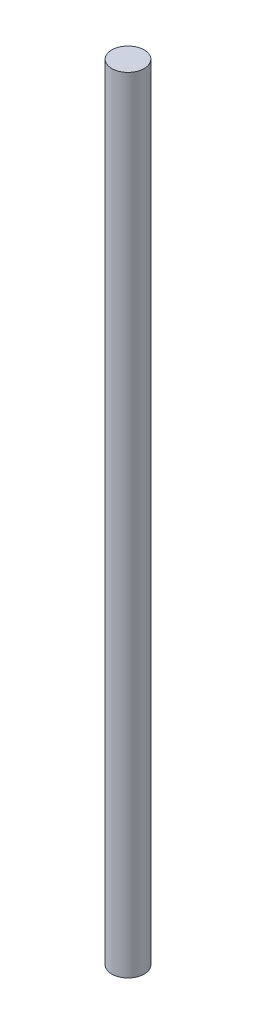
ISO-10303-21;
HEADER;
FILE_DESCRIPTION(('STEP AP214'),'2;1');
FILE_NAME('part.step','',(''),(''),'','','');
FILE_SCHEMA(('AUTOMOTIVE_DESIGN { 1 0 10303 214 1 1 1 1 }'));
ENDSEC;
DATA;
#1=APPLICATION_CONTEXT('core data for automotive mechanical design processes');
#2=APPLICATION_PROTOCOL_DEFINITION('international standard','automotive_design',2000,#1);
#3=PRODUCT_CONTEXT('',#1,'mechanical');
#4=PRODUCT('Part','Part','',(#3));
#5=PRODUCT_RELATED_PRODUCT_CATEGORY('part','',(#4));
#6=PRODUCT_DEFINITION_FORMATION('','',#4);
#7=PRODUCT_DEFINITION_CONTEXT('part definition',#1,'design');
#8=PRODUCT_DEFINITION('design','',#6,#7);
#9=PRODUCT_DEFINITION_SHAPE('','',#8);
#10=(LENGTH_UNIT() NAMED_UNIT(*) SI_UNIT(.MILLI.,.METRE.));
#11=(NAMED_UNIT(*) PLANE_ANGLE_UNIT() SI_UNIT($,.RADIAN.));
#12=(NAMED_UNIT(*) SI_UNIT($,.STERADIAN.) SOLID_ANGLE_UNIT());
#13=UNCERTAINTY_MEASURE_WITH_UNIT(LENGTH_MEASURE(1.E-05),#10,'distance_accuracy_value','');
#14=(GEOMETRIC_REPRESENTATION_CONTEXT(3) GLOBAL_UNCERTAINTY_ASSIGNED_CONTEXT((#13)) GLOBAL_UNIT_ASSIGNED_CONTEXT((#10,
#11,#12)) REPRESENTATION_CONTEXT('',''));
#15=CARTESIAN_POINT('',(0.,0.,0.));
#16=DIRECTION('',(0.,0.,1.));
#17=DIRECTION('',(1.,0.,0.));
#18=AXIS2_PLACEMENT_3D('',#15,#16,#17);
#19=CARTESIAN_POINT('',(0.,97.,0.));
#20=DIRECTION('',(0.,-1.,0.));
#21=DIRECTION('',(0.,0.,-1.));
#22=AXIS2_PLACEMENT_3D('',#19,#20,#21);
#23=CYLINDRICAL_SURFACE('',#22,2.);
#24=CARTESIAN_POINT('',(0.,97.,0.));
#25=DIRECTION('',(0.,1.,0.));
#26=DIRECTION('',(0.,0.,1.));
#27=AXIS2_PLACEMENT_3D('',#24,#25,#26);
#28=CIRCLE('',#27,2.);
#29=CARTESIAN_POINT('',(0.,97.,2.));
#30=VERTEX_POINT('',#29);
#31=EDGE_CURVE('E10',#30,#30,#28,.T.);
#32=ORIENTED_EDGE('',*,*,#31,.F.);
#33=EDGE_LOOP('',(#32));
#34=FACE_BOUND('',#33,.T.);
#35=CARTESIAN_POINT('',(0.,0.,0.));
#36=DIRECTION('',(0.,1.,0.));
#37=DIRECTION('',(0.,0.,1.));
#38=AXIS2_PLACEMENT_3D('',#35,#36,#37);
#39=CIRCLE('',#38,2.);
#40=CARTESIAN_POINT('',(0.,0.,2.));
#41=VERTEX_POINT('',#40);
#42=EDGE_CURVE('E40',#41,#41,#39,.T.);
#43=ORIENTED_EDGE('',*,*,#42,.T.);
#44=EDGE_LOOP('',(#43));
#45=FACE_BOUND('',#44,.T.);
#46=ADVANCED_FACE('F37',(#34,#45),#23,.T.);
#47=CARTESIAN_POINT('',(0.,97.,0.));
#48=DIRECTION('',(0.,1.,0.));
#49=DIRECTION('',(0.,0.,1.));
#50=AXIS2_PLACEMENT_3D('',#47,#48,#49);
#51=PLANE('',#50);
#52=ORIENTED_EDGE('',*,*,#31,.T.);
#53=EDGE_LOOP('',(#52));
#54=FACE_BOUND('',#53,.T.);
#55=ADVANCED_FACE('F54',(#54),#51,.T.);
#56=CARTESIAN_POINT('',(0.,0.,0.));
#57=DIRECTION('',(0.,1.,0.));
#58=DIRECTION('',(0.,0.,1.));
#59=AXIS2_PLACEMENT_3D('',#56,#57,#58);
#60=PLANE('',#59);
#61=ORIENTED_EDGE('',*,*,#42,.F.);
#62=EDGE_LOOP('',(#61));
#63=FACE_BOUND('',#62,.T.);
#64=ADVANCED_FACE('F52',(#63),#60,.F.);
#65=CLOSED_SHELL('',(#46,#55,#64));
#66=MANIFOLD_SOLID_BREP('B2',#65);
#67=ADVANCED_BREP_SHAPE_REPRESENTATION('',(#18,#66),#14);
#68=SHAPE_DEFINITION_REPRESENTATION(#9,#67);
ENDSEC;
END-ISO-10303-21;
